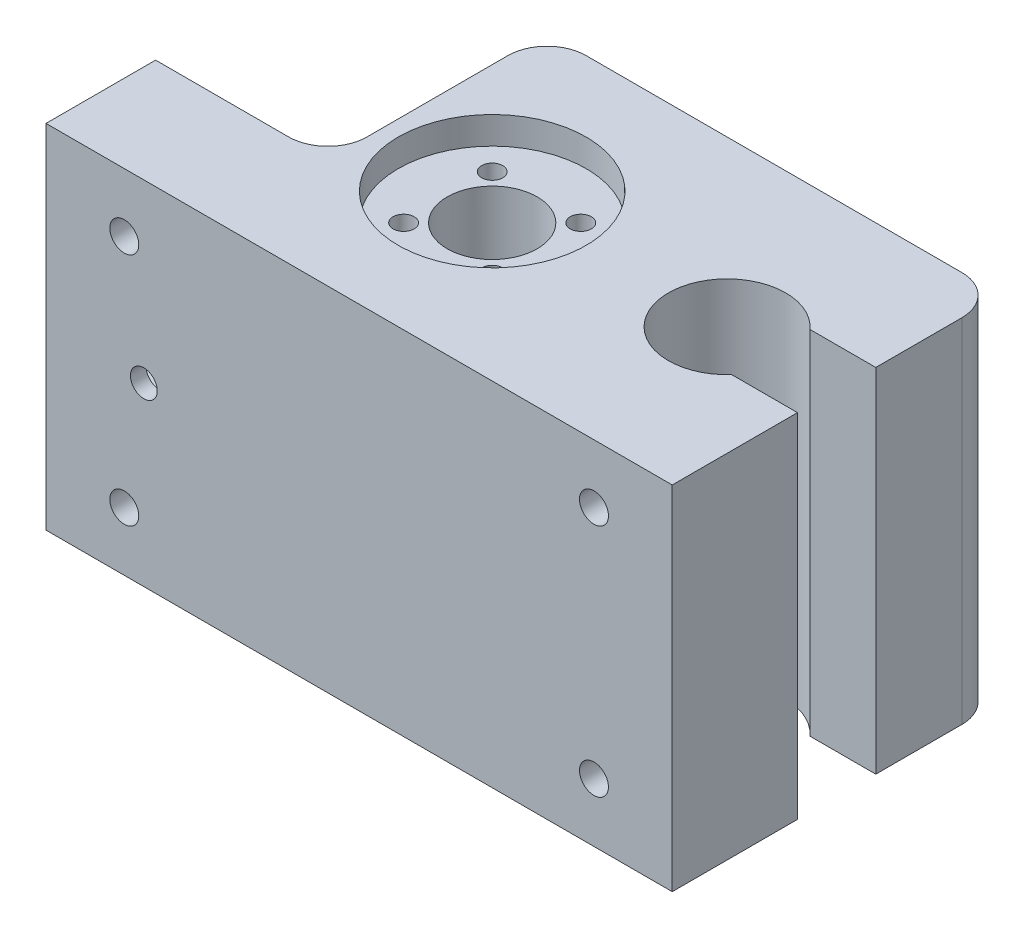
ISO-10303-21;
HEADER;
FILE_DESCRIPTION(('STEP AP214'),'2;1');
FILE_NAME('part.step','',(''),(''),'','','');
FILE_SCHEMA(('AUTOMOTIVE_DESIGN { 1 0 10303 214 1 1 1 1 }'));
ENDSEC;
DATA;
#1=APPLICATION_CONTEXT('core data for automotive mechanical design processes');
#2=APPLICATION_PROTOCOL_DEFINITION('international standard','automotive_design',2000,#1);
#3=PRODUCT_CONTEXT('',#1,'mechanical');
#4=PRODUCT('Part','Part','',(#3));
#5=PRODUCT_RELATED_PRODUCT_CATEGORY('part','',(#4));
#6=PRODUCT_DEFINITION_FORMATION('','',#4);
#7=PRODUCT_DEFINITION_CONTEXT('part definition',#1,'design');
#8=PRODUCT_DEFINITION('design','',#6,#7);
#9=PRODUCT_DEFINITION_SHAPE('','',#8);
#10=(LENGTH_UNIT() NAMED_UNIT(*) SI_UNIT(.MILLI.,.METRE.));
#11=(NAMED_UNIT(*) PLANE_ANGLE_UNIT() SI_UNIT($,.RADIAN.));
#12=(NAMED_UNIT(*) SI_UNIT($,.STERADIAN.) SOLID_ANGLE_UNIT());
#13=UNCERTAINTY_MEASURE_WITH_UNIT(LENGTH_MEASURE(1.E-05),#10,'distance_accuracy_value','');
#14=(GEOMETRIC_REPRESENTATION_CONTEXT(3) GLOBAL_UNCERTAINTY_ASSIGNED_CONTEXT((#13)) GLOBAL_UNIT_ASSIGNED_CONTEXT((#10,
#11,#12)) REPRESENTATION_CONTEXT('',''));
#15=CARTESIAN_POINT('',(0.,0.,0.));
#16=DIRECTION('',(0.,0.,1.));
#17=DIRECTION('',(1.,0.,0.));
#18=AXIS2_PLACEMENT_3D('',#15,#16,#17);
#19=CARTESIAN_POINT('',(41.6568542494964,26.5,15.3431457505133));
#20=DIRECTION('',(0.,1.,0.));
#21=DIRECTION('',(-1.,0.,0.));
#22=AXIS2_PLACEMENT_3D('',#19,#20,#21);
#23=CYLINDRICAL_SURFACE('',#22,1.35);
#24=CARTESIAN_POINT('',(41.6568542494964,41.5,15.3431457505133));
#25=DIRECTION('',(0.,1.,0.));
#26=DIRECTION('',(-1.,0.,0.));
#27=AXIS2_PLACEMENT_3D('',#24,#25,#26);
#28=CIRCLE('',#27,1.35);
#29=CARTESIAN_POINT('',(40.3068542494964,41.5,15.3431457505133));
#30=VERTEX_POINT('',#29);
#31=EDGE_CURVE('E348',#30,#30,#28,.T.);
#32=ORIENTED_EDGE('',*,*,#31,.T.);
#33=EDGE_LOOP('',(#32));
#34=FACE_BOUND('',#33,.T.);
#35=CARTESIAN_POINT('',(41.6568542494964,31.,15.3431457505133));
#36=DIRECTION('',(0.,-1.,0.));
#37=DIRECTION('',(1.,0.,0.));
#38=AXIS2_PLACEMENT_3D('',#35,#36,#37);
#39=CIRCLE('',#38,1.35);
#40=CARTESIAN_POINT('',(43.0068542494964,31.,15.3431457505133));
#41=VERTEX_POINT('',#40);
#42=EDGE_CURVE('E286',#41,#41,#39,.F.);
#43=ORIENTED_EDGE('',*,*,#42,.F.);
#44=EDGE_LOOP('',(#43));
#45=FACE_BOUND('',#44,.T.);
#46=ADVANCED_FACE('F35',(#34,#45),#23,.F.);
#47=CARTESIAN_POINT('',(41.6568542494967,26.5,26.656854249498));
#48=DIRECTION('',(0.,1.,0.));
#49=DIRECTION('',(-1.,0.,0.));
#50=AXIS2_PLACEMENT_3D('',#47,#48,#49);
#51=CYLINDRICAL_SURFACE('',#50,1.35);
#52=CARTESIAN_POINT('',(41.6568542494967,41.5,26.656854249498));
#53=DIRECTION('',(0.,1.,0.));
#54=DIRECTION('',(-1.,0.,0.));
#55=AXIS2_PLACEMENT_3D('',#52,#53,#54);
#56=CIRCLE('',#55,1.35);
#57=CARTESIAN_POINT('',(40.3068542494967,41.5,26.656854249498));
#58=VERTEX_POINT('',#57);
#59=EDGE_CURVE('E345',#58,#58,#56,.T.);
#60=ORIENTED_EDGE('',*,*,#59,.T.);
#61=EDGE_LOOP('',(#60));
#62=FACE_BOUND('',#61,.T.);
#63=CARTESIAN_POINT('',(41.6568542494967,31.,26.656854249498));
#64=DIRECTION('',(0.,-1.,0.));
#65=DIRECTION('',(1.,0.,0.));
#66=AXIS2_PLACEMENT_3D('',#63,#64,#65);
#67=CIRCLE('',#66,1.35);
#68=CARTESIAN_POINT('',(43.0068542494967,31.,26.656854249498));
#69=VERTEX_POINT('',#68);
#70=EDGE_CURVE('E280',#69,#69,#67,.F.);
#71=ORIENTED_EDGE('',*,*,#70,.F.);
#72=EDGE_LOOP('',(#71));
#73=FACE_BOUND('',#72,.T.);
#74=ADVANCED_FACE('F401',(#62,#73),#51,.F.);
#75=CARTESIAN_POINT('',(30.3431457505119,26.5,26.6568542494983));
#76=DIRECTION('',(0.,1.,0.));
#77=DIRECTION('',(-1.,0.,0.));
#78=AXIS2_PLACEMENT_3D('',#75,#76,#77);
#79=CYLINDRICAL_SURFACE('',#78,1.35);
#80=CARTESIAN_POINT('',(30.3431457505119,41.5,26.6568542494983));
#81=DIRECTION('',(0.,1.,0.));
#82=DIRECTION('',(-1.,0.,0.));
#83=AXIS2_PLACEMENT_3D('',#80,#81,#82);
#84=CIRCLE('',#83,1.35);
#85=CARTESIAN_POINT('',(28.9931457505119,41.5,26.6568542494983));
#86=VERTEX_POINT('',#85);
#87=EDGE_CURVE('E349',#86,#86,#84,.T.);
#88=ORIENTED_EDGE('',*,*,#87,.T.);
#89=EDGE_LOOP('',(#88));
#90=FACE_BOUND('',#89,.T.);
#91=CARTESIAN_POINT('',(30.3431457505119,31.,26.6568542494983));
#92=DIRECTION('',(0.,-1.,0.));
#93=DIRECTION('',(1.,0.,0.));
#94=AXIS2_PLACEMENT_3D('',#91,#92,#93);
#95=CIRCLE('',#94,1.35);
#96=CARTESIAN_POINT('',(31.6931457505119,31.,26.6568542494983));
#97=VERTEX_POINT('',#96);
#98=EDGE_CURVE('E275',#97,#97,#95,.F.);
#99=ORIENTED_EDGE('',*,*,#98,.F.);
#100=EDGE_LOOP('',(#99));
#101=FACE_BOUND('',#100,.T.);
#102=ADVANCED_FACE('F407',(#90,#101),#79,.F.);
#103=CARTESIAN_POINT('',(30.3431457505116,26.5,15.3431457505136));
#104=DIRECTION('',(0.,1.,0.));
#105=DIRECTION('',(-1.,0.,0.));
#106=AXIS2_PLACEMENT_3D('',#103,#104,#105);
#107=CYLINDRICAL_SURFACE('',#106,1.35);
#108=CARTESIAN_POINT('',(30.3431457505116,41.5,15.3431457505136));
#109=DIRECTION('',(0.,1.,0.));
#110=DIRECTION('',(-1.,0.,0.));
#111=AXIS2_PLACEMENT_3D('',#108,#109,#110);
#112=CIRCLE('',#111,1.35);
#113=CARTESIAN_POINT('',(28.9931457505116,41.5,15.3431457505136));
#114=VERTEX_POINT('',#113);
#115=EDGE_CURVE('E344',#114,#114,#112,.T.);
#116=ORIENTED_EDGE('',*,*,#115,.T.);
#117=EDGE_LOOP('',(#116));
#118=FACE_BOUND('',#117,.T.);
#119=CARTESIAN_POINT('',(30.3431457505116,31.,15.3431457505136));
#120=DIRECTION('',(0.,-1.,0.));
#121=DIRECTION('',(1.,0.,0.));
#122=AXIS2_PLACEMENT_3D('',#119,#120,#121);
#123=CIRCLE('',#122,1.35);
#124=CARTESIAN_POINT('',(31.6931457505116,31.,15.3431457505136));
#125=VERTEX_POINT('',#124);
#126=EDGE_CURVE('E271',#125,#125,#123,.F.);
#127=ORIENTED_EDGE('',*,*,#126,.F.);
#128=EDGE_LOOP('',(#127));
#129=FACE_BOUND('',#128,.T.);
#130=ADVANCED_FACE('F413',(#118,#129),#107,.F.);
#131=CARTESIAN_POINT('',(36.0000000000003,0.,21.0000000000058));
#132=DIRECTION('',(0.,1.,0.));
#133=DIRECTION('',(-1.,0.,0.));
#134=AXIS2_PLACEMENT_3D('',#131,#132,#133);
#135=CYLINDRICAL_SURFACE('',#134,5.75);
#136=CARTESIAN_POINT('',(36.0000000000003,41.5,21.0000000000058));
#137=DIRECTION('',(0.,1.,0.));
#138=DIRECTION('',(-1.,0.,0.));
#139=AXIS2_PLACEMENT_3D('',#136,#137,#138);
#140=CIRCLE('',#139,5.75);
#141=CARTESIAN_POINT('',(30.2500000000003,41.5,21.0000000000058));
#142=VERTEX_POINT('',#141);
#143=EDGE_CURVE('E339',#142,#142,#140,.T.);
#144=ORIENTED_EDGE('',*,*,#143,.T.);
#145=EDGE_LOOP('',(#144));
#146=FACE_BOUND('',#145,.T.);
#147=CARTESIAN_POINT('',(36.0000000000003,31.,21.0000000000058));
#148=DIRECTION('',(0.,-1.,0.));
#149=DIRECTION('',(1.,0.,0.));
#150=AXIS2_PLACEMENT_3D('',#147,#148,#149);
#151=CIRCLE('',#150,5.75);
#152=CARTESIAN_POINT('',(41.7500000000003,31.,21.0000000000058));
#153=VERTEX_POINT('',#152);
#154=EDGE_CURVE('E166',#153,#153,#151,.F.);
#155=ORIENTED_EDGE('',*,*,#154,.F.);
#156=EDGE_LOOP('',(#155));
#157=FACE_BOUND('',#156,.T.);
#158=ADVANCED_FACE('F591',(#146,#157),#135,.F.);
#159=CARTESIAN_POINT('',(80.,0.,42.));
#160=DIRECTION('',(-1.,0.,0.));
#161=DIRECTION('',(0.,0.,1.));
#162=AXIS2_PLACEMENT_3D('',#159,#160,#161);
#163=PLANE('',#162);
#164=DIRECTION('',(0.,0.,-1.));
#165=VECTOR('',#164,1.);
#166=CARTESIAN_POINT('',(80.,0.,42.));
#167=LINE('',#166,#165);
#168=CARTESIAN_POINT('',(80.,0.,42.));
#169=VERTEX_POINT('',#168);
#170=CARTESIAN_POINT('',(80.,0.,26.000000000006));
#171=VERTEX_POINT('',#170);
#172=EDGE_CURVE('E229',#169,#171,#167,.T.);
#173=ORIENTED_EDGE('',*,*,#172,.T.);
#174=DIRECTION('',(0.,1.,0.));
#175=VECTOR('',#174,1.);
#176=CARTESIAN_POINT('',(80.,0.,26.000000000006));
#177=LINE('',#176,#175);
#178=CARTESIAN_POINT('',(80.,45.,26.000000000006));
#179=VERTEX_POINT('',#178);
#180=EDGE_CURVE('E331',#171,#179,#177,.T.);
#181=ORIENTED_EDGE('',*,*,#180,.T.);
#182=DIRECTION('',(0.,0.,-1.));
#183=VECTOR('',#182,1.);
#184=CARTESIAN_POINT('',(80.,45.,42.));
#185=LINE('',#184,#183);
#186=CARTESIAN_POINT('',(80.,45.,42.));
#187=VERTEX_POINT('',#186);
#188=EDGE_CURVE('E225',#187,#179,#185,.T.);
#189=ORIENTED_EDGE('',*,*,#188,.F.);
#190=DIRECTION('',(0.,1.,0.));
#191=VECTOR('',#190,1.);
#192=CARTESIAN_POINT('',(80.,0.,42.));
#193=LINE('',#192,#191);
#194=EDGE_CURVE('E213',#169,#187,#193,.T.);
#195=ORIENTED_EDGE('',*,*,#194,.F.);
#196=EDGE_LOOP('',(#173,#181,#189,#195));
#197=FACE_BOUND('',#196,.T.);
#198=ADVANCED_FACE('F454',(#197),#163,.F.);
#199=CARTESIAN_POINT('',(0.,0.,42.));
#200=DIRECTION('',(1.,0.,0.));
#201=DIRECTION('',(0.,1.,0.));
#202=AXIS2_PLACEMENT_3D('',#199,#200,#201);
#203=PLANE('',#202);
#204=DIRECTION('',(0.,0.,1.));
#205=VECTOR('',#204,1.);
#206=CARTESIAN_POINT('',(0.,14.,30.));
#207=LINE('',#206,#205);
#208=CARTESIAN_POINT('',(0.,14.,30.));
#209=VERTEX_POINT('',#208);
#210=CARTESIAN_POINT('',(0.,14.,40.));
#211=VERTEX_POINT('',#210);
#212=EDGE_CURVE('E370',#209,#211,#207,.T.);
#213=ORIENTED_EDGE('',*,*,#212,.F.);
#214=DIRECTION('',(0.,-1.,0.));
#215=VECTOR('',#214,1.);
#216=CARTESIAN_POINT('',(0.,31.,30.));
#217=LINE('',#216,#215);
#218=CARTESIAN_POINT('',(0.,31.,30.));
#219=VERTEX_POINT('',#218);
#220=EDGE_CURVE('E360',#219,#209,#217,.T.);
#221=ORIENTED_EDGE('',*,*,#220,.F.);
#222=DIRECTION('',(0.,0.,-1.));
#223=VECTOR('',#222,1.);
#224=CARTESIAN_POINT('',(0.,31.,30.));
#225=LINE('',#224,#223);
#226=CARTESIAN_POINT('',(0.,31.,40.));
#227=VERTEX_POINT('',#226);
#228=EDGE_CURVE('E182',#227,#219,#225,.T.);
#229=ORIENTED_EDGE('',*,*,#228,.F.);
#230=DIRECTION('',(0.,1.,0.));
#231=VECTOR('',#230,1.);
#232=CARTESIAN_POINT('',(0.,31.,40.));
#233=LINE('',#232,#231);
#234=EDGE_CURVE('E372',#211,#227,#233,.T.);
#235=ORIENTED_EDGE('',*,*,#234,.F.);
#236=EDGE_LOOP('',(#213,#221,#229,#235));
#237=FACE_BOUND('',#236,.T.);
#238=DIRECTION('',(0.,0.,-1.));
#239=VECTOR('',#238,1.);
#240=CARTESIAN_POINT('',(0.,45.,42.));
#241=LINE('',#240,#239);
#242=CARTESIAN_POINT('',(0.,45.,42.));
#243=VERTEX_POINT('',#242);
#244=CARTESIAN_POINT('',(0.,45.,28.));
#245=VERTEX_POINT('',#244);
#246=EDGE_CURVE('E217',#243,#245,#241,.T.);
#247=ORIENTED_EDGE('',*,*,#246,.T.);
#248=DIRECTION('',(0.,1.,0.));
#249=VECTOR('',#248,1.);
#250=CARTESIAN_POINT('',(0.,0.,28.));
#251=LINE('',#250,#249);
#252=CARTESIAN_POINT('',(0.,0.,28.));
#253=VERTEX_POINT('',#252);
#254=EDGE_CURVE('E202',#253,#245,#251,.T.);
#255=ORIENTED_EDGE('',*,*,#254,.F.);
#256=DIRECTION('',(0.,0.,-1.));
#257=VECTOR('',#256,1.);
#258=CARTESIAN_POINT('',(0.,0.,42.));
#259=LINE('',#258,#257);
#260=CARTESIAN_POINT('',(0.,0.,42.));
#261=VERTEX_POINT('',#260);
#262=EDGE_CURVE('E232',#261,#253,#259,.T.);
#263=ORIENTED_EDGE('',*,*,#262,.F.);
#264=DIRECTION('',(0.,-1.,0.));
#265=VECTOR('',#264,1.);
#266=CARTESIAN_POINT('',(0.,0.,42.));
#267=LINE('',#266,#265);
#268=EDGE_CURVE('E207',#243,#261,#267,.T.);
#269=ORIENTED_EDGE('',*,*,#268,.F.);
#270=EDGE_LOOP('',(#247,#255,#263,#269));
#271=FACE_BOUND('',#270,.T.);
#272=ADVANCED_FACE('F381',(#237,#271),#203,.F.);
#273=CARTESIAN_POINT('',(0.,0.,42.));
#274=DIRECTION('',(0.,1.,0.));
#275=DIRECTION('',(-1.,0.,0.));
#276=AXIS2_PLACEMENT_3D('',#273,#274,#275);
#277=PLANE('',#276);
#278=CARTESIAN_POINT('',(36.0000000000003,0.,21.0000000000058));
#279=DIRECTION('',(0.,-1.,0.));
#280=DIRECTION('',(1.,0.,0.));
#281=AXIS2_PLACEMENT_3D('',#278,#279,#280);
#282=CIRCLE('',#281,12.5);
#283=CARTESIAN_POINT('',(48.5000000000003,0.,21.0000000000058));
#284=VERTEX_POINT('',#283);
#285=EDGE_CURVE('E167',#284,#284,#282,.T.);
#286=ORIENTED_EDGE('',*,*,#285,.F.);
#287=EDGE_LOOP('',(#286));
#288=FACE_BOUND('',#287,.T.);
#289=DIRECTION('',(1.,0.,0.));
#290=VECTOR('',#289,1.);
#291=CARTESIAN_POINT('',(0.,0.,0.));
#292=LINE('',#291,#290);
#293=CARTESIAN_POINT('',(27.,0.,0.));
#294=VERTEX_POINT('',#293);
#295=CARTESIAN_POINT('',(75.,0.,0.));
#296=VERTEX_POINT('',#295);
#297=EDGE_CURVE('E206',#294,#296,#292,.T.);
#298=ORIENTED_EDGE('',*,*,#297,.T.);
#299=CARTESIAN_POINT('',(75.,0.,5.));
#300=DIRECTION('',(0.,1.,0.));
#301=DIRECTION('',(-1.,0.,0.));
#302=AXIS2_PLACEMENT_3D('',#299,#300,#301);
#303=CIRCLE('',#302,5.);
#304=CARTESIAN_POINT('',(80.,0.,5.00000000000001));
#305=VERTEX_POINT('',#304);
#306=EDGE_CURVE('E260',#296,#305,#303,.F.);
#307=ORIENTED_EDGE('',*,*,#306,.T.);
#308=CARTESIAN_POINT('',(80.,0.,16.000000000006));
#309=VERTEX_POINT('',#308);
#310=EDGE_CURVE('E228',#309,#305,#167,.T.);
#311=ORIENTED_EDGE('',*,*,#310,.F.);
#312=DIRECTION('',(-1.,0.,0.));
#313=VECTOR('',#312,1.);
#314=CARTESIAN_POINT('',(67.9004612587687,0.,16.000000000006));
#315=LINE('',#314,#313);
#316=CARTESIAN_POINT('',(71.5901699437497,0.,16.000000000006));
#317=VERTEX_POINT('',#316);
#318=EDGE_CURVE('E321',#309,#317,#315,.T.);
#319=ORIENTED_EDGE('',*,*,#318,.T.);
#320=CARTESIAN_POINT('',(66.0000000000002,0.,21.000000000006));
#321=DIRECTION('',(0.,1.,0.));
#322=DIRECTION('',(-1.,0.,0.));
#323=AXIS2_PLACEMENT_3D('',#320,#321,#322);
#324=CIRCLE('',#323,7.5);
#325=CARTESIAN_POINT('',(71.5901699437497,0.,26.000000000006));
#326=VERTEX_POINT('',#325);
#327=EDGE_CURVE('E336',#317,#326,#324,.T.);
#328=ORIENTED_EDGE('',*,*,#327,.T.);
#329=DIRECTION('',(1.,0.,0.));
#330=VECTOR('',#329,1.);
#331=CARTESIAN_POINT('',(67.9004612587687,0.,26.000000000006));
#332=LINE('',#331,#330);
#333=EDGE_CURVE('E324',#326,#171,#332,.T.);
#334=ORIENTED_EDGE('',*,*,#333,.T.);
#335=ORIENTED_EDGE('',*,*,#172,.F.);
#336=DIRECTION('',(1.,0.,0.));
#337=VECTOR('',#336,1.);
#338=CARTESIAN_POINT('',(0.,0.,42.));
#339=LINE('',#338,#337);
#340=EDGE_CURVE('E210',#261,#169,#339,.T.);
#341=ORIENTED_EDGE('',*,*,#340,.F.);
#342=ORIENTED_EDGE('',*,*,#262,.T.);
#343=DIRECTION('',(1.,0.,0.));
#344=VECTOR('',#343,1.);
#345=CARTESIAN_POINT('',(0.,0.,28.));
#346=LINE('',#345,#344);
#347=CARTESIAN_POINT('',(17.,0.,28.));
#348=VERTEX_POINT('',#347);
#349=EDGE_CURVE('E198',#253,#348,#346,.T.);
#350=ORIENTED_EDGE('',*,*,#349,.T.);
#351=CARTESIAN_POINT('',(17.,0.,23.));
#352=DIRECTION('',(0.,1.,0.));
#353=DIRECTION('',(-1.,0.,0.));
#354=AXIS2_PLACEMENT_3D('',#351,#352,#353);
#355=CIRCLE('',#354,5.);
#356=CARTESIAN_POINT('',(22.,0.,23.));
#357=VERTEX_POINT('',#356);
#358=EDGE_CURVE('E43',#348,#357,#355,.T.);
#359=ORIENTED_EDGE('',*,*,#358,.T.);
#360=DIRECTION('',(0.,0.,-1.));
#361=VECTOR('',#360,1.);
#362=CARTESIAN_POINT('',(22.,0.,28.));
#363=LINE('',#362,#361);
#364=CARTESIAN_POINT('',(22.,0.,5.));
#365=VERTEX_POINT('',#364);
#366=EDGE_CURVE('E201',#357,#365,#363,.T.);
#367=ORIENTED_EDGE('',*,*,#366,.T.);
#368=CARTESIAN_POINT('',(27.,0.,5.));
#369=DIRECTION('',(0.,1.,0.));
#370=DIRECTION('',(-1.,0.,0.));
#371=AXIS2_PLACEMENT_3D('',#368,#369,#370);
#372=CIRCLE('',#371,5.);
#373=EDGE_CURVE('E258',#365,#294,#372,.F.);
#374=ORIENTED_EDGE('',*,*,#373,.T.);
#375=EDGE_LOOP('',(#298,#307,#311,#319,#328,#334,#335,#341,#342,#350,#359,#367,#374));
#376=FACE_BOUND('',#375,.T.);
#377=ADVANCED_FACE('F451',(#288,#376),#277,.F.);
#378=ORIENTED_EDGE('',*,*,#310,.T.);
#379=DIRECTION('',(0.,1.,0.));
#380=VECTOR('',#379,1.);
#381=CARTESIAN_POINT('',(80.,45.,5.));
#382=LINE('',#381,#380);
#383=CARTESIAN_POINT('',(80.,45.,5.00000000000001));
#384=VERTEX_POINT('',#383);
#385=EDGE_CURVE('E241',#305,#384,#382,.T.);
#386=ORIENTED_EDGE('',*,*,#385,.T.);
#387=CARTESIAN_POINT('',(80.,45.,16.000000000006));
#388=VERTEX_POINT('',#387);
#389=EDGE_CURVE('E224',#388,#384,#185,.T.);
#390=ORIENTED_EDGE('',*,*,#389,.F.);
#391=DIRECTION('',(0.,1.,0.));
#392=VECTOR('',#391,1.);
#393=CARTESIAN_POINT('',(80.,0.,16.000000000006));
#394=LINE('',#393,#392);
#395=EDGE_CURVE('E328',#309,#388,#394,.T.);
#396=ORIENTED_EDGE('',*,*,#395,.F.);
#397=EDGE_LOOP('',(#378,#386,#390,#396));
#398=FACE_BOUND('',#397,.T.);
#399=ADVANCED_FACE('F441',(#398),#163,.F.);
#400=CARTESIAN_POINT('',(0.,45.,42.));
#401=DIRECTION('',(0.,-1.,0.));
#402=DIRECTION('',(1.,0.,0.));
#403=AXIS2_PLACEMENT_3D('',#400,#401,#402);
#404=PLANE('',#403);
#405=ORIENTED_EDGE('',*,*,#389,.T.);
#406=CARTESIAN_POINT('',(75.,45.,5.));
#407=DIRECTION('',(0.,-1.,0.));
#408=DIRECTION('',(1.,0.,0.));
#409=AXIS2_PLACEMENT_3D('',#406,#407,#408);
#410=CIRCLE('',#409,5.);
#411=CARTESIAN_POINT('',(75.,45.,0.));
#412=VERTEX_POINT('',#411);
#413=EDGE_CURVE('E251',#384,#412,#410,.F.);
#414=ORIENTED_EDGE('',*,*,#413,.T.);
#415=DIRECTION('',(-1.,0.,0.));
#416=VECTOR('',#415,1.);
#417=CARTESIAN_POINT('',(0.,45.,0.));
#418=LINE('',#417,#416);
#419=CARTESIAN_POINT('',(27.,45.,0.));
#420=VERTEX_POINT('',#419);
#421=EDGE_CURVE('E211',#412,#420,#418,.T.);
#422=ORIENTED_EDGE('',*,*,#421,.T.);
#423=CARTESIAN_POINT('',(27.,45.,5.));
#424=DIRECTION('',(0.,-1.,0.));
#425=DIRECTION('',(1.,0.,0.));
#426=AXIS2_PLACEMENT_3D('',#423,#424,#425);
#427=CIRCLE('',#426,5.);
#428=CARTESIAN_POINT('',(22.,45.,5.));
#429=VERTEX_POINT('',#428);
#430=EDGE_CURVE('E249',#420,#429,#427,.F.);
#431=ORIENTED_EDGE('',*,*,#430,.T.);
#432=DIRECTION('',(0.,0.,-1.));
#433=VECTOR('',#432,1.);
#434=CARTESIAN_POINT('',(22.,45.,28.));
#435=LINE('',#434,#433);
#436=CARTESIAN_POINT('',(22.,45.,23.));
#437=VERTEX_POINT('',#436);
#438=EDGE_CURVE('E188',#437,#429,#435,.T.);
#439=ORIENTED_EDGE('',*,*,#438,.F.);
#440=CARTESIAN_POINT('',(17.,45.,23.));
#441=DIRECTION('',(0.,-1.,0.));
#442=DIRECTION('',(1.,0.,0.));
#443=AXIS2_PLACEMENT_3D('',#440,#441,#442);
#444=CIRCLE('',#443,5.);
#445=CARTESIAN_POINT('',(17.,45.,28.));
#446=VERTEX_POINT('',#445);
#447=EDGE_CURVE('E268',#437,#446,#444,.T.);
#448=ORIENTED_EDGE('',*,*,#447,.T.);
#449=DIRECTION('',(1.,0.,0.));
#450=VECTOR('',#449,1.);
#451=CARTESIAN_POINT('',(0.,45.,28.));
#452=LINE('',#451,#450);
#453=EDGE_CURVE('E184',#245,#446,#452,.T.);
#454=ORIENTED_EDGE('',*,*,#453,.F.);
#455=ORIENTED_EDGE('',*,*,#246,.F.);
#456=DIRECTION('',(-1.,0.,0.));
#457=VECTOR('',#456,1.);
#458=CARTESIAN_POINT('',(0.,45.,42.));
#459=LINE('',#458,#457);
#460=EDGE_CURVE('E215',#187,#243,#459,.T.);
#461=ORIENTED_EDGE('',*,*,#460,.F.);
#462=ORIENTED_EDGE('',*,*,#188,.T.);
#463=DIRECTION('',(1.,0.,0.));
#464=VECTOR('',#463,1.);
#465=CARTESIAN_POINT('',(67.9004612587687,45.,26.000000000006));
#466=LINE('',#465,#464);
#467=CARTESIAN_POINT('',(71.5901699437497,45.,26.000000000006));
#468=VERTEX_POINT('',#467);
#469=EDGE_CURVE('E325',#468,#179,#466,.T.);
#470=ORIENTED_EDGE('',*,*,#469,.F.);
#471=CARTESIAN_POINT('',(66.0000000000002,45.,21.000000000006));
#472=DIRECTION('',(0.,1.,0.));
#473=DIRECTION('',(-1.,0.,0.));
#474=AXIS2_PLACEMENT_3D('',#471,#472,#473);
#475=CIRCLE('',#474,7.5);
#476=CARTESIAN_POINT('',(71.5901699437497,45.,16.000000000006));
#477=VERTEX_POINT('',#476);
#478=EDGE_CURVE('E334',#477,#468,#475,.T.);
#479=ORIENTED_EDGE('',*,*,#478,.F.);
#480=DIRECTION('',(-1.,0.,0.));
#481=VECTOR('',#480,1.);
#482=CARTESIAN_POINT('',(67.9004612587687,45.,16.000000000006));
#483=LINE('',#482,#481);
#484=EDGE_CURVE('E320',#388,#477,#483,.T.);
#485=ORIENTED_EDGE('',*,*,#484,.F.);
#486=EDGE_LOOP('',(#405,#414,#422,#431,#439,#448,#454,#455,#461,#462,#470,#479,#485));
#487=FACE_BOUND('',#486,.T.);
#488=CARTESIAN_POINT('',(36.0000000000003,45.,21.0000000000058));
#489=DIRECTION('',(0.,1.,0.));
#490=DIRECTION('',(-1.,0.,0.));
#491=AXIS2_PLACEMENT_3D('',#488,#489,#490);
#492=CIRCLE('',#491,12.);
#493=CARTESIAN_POINT('',(24.0000000000003,45.,21.0000000000058));
#494=VERTEX_POINT('',#493);
#495=EDGE_CURVE('E356',#494,#494,#492,.T.);
#496=ORIENTED_EDGE('',*,*,#495,.F.);
#497=EDGE_LOOP('',(#496));
#498=FACE_BOUND('',#497,.T.);
#499=ADVANCED_FACE('F438',(#487,#498),#404,.F.);
#500=CARTESIAN_POINT('',(0.,0.,42.));
#501=DIRECTION('',(0.,0.,-1.));
#502=DIRECTION('',(-1.,0.,0.));
#503=AXIS2_PLACEMENT_3D('',#500,#501,#502);
#504=PLANE('',#503);
#505=CARTESIAN_POINT('',(9.99999999999999,7.5,42.));
#506=DIRECTION('',(0.,0.,1.));
#507=DIRECTION('',(1.,0.,0.));
#508=AXIS2_PLACEMENT_3D('',#505,#506,#507);
#509=CIRCLE('',#508,1.85);
#510=CARTESIAN_POINT('',(11.85,7.5,42.));
#511=VERTEX_POINT('',#510);
#512=EDGE_CURVE('E176',#511,#511,#509,.T.);
#513=ORIENTED_EDGE('',*,*,#512,.F.);
#514=EDGE_LOOP('',(#513));
#515=FACE_BOUND('',#514,.T.);
#516=CARTESIAN_POINT('',(70.,7.5,42.));
#517=DIRECTION('',(0.,0.,1.));
#518=DIRECTION('',(1.,0.,0.));
#519=AXIS2_PLACEMENT_3D('',#516,#517,#518);
#520=CIRCLE('',#519,1.85);
#521=CARTESIAN_POINT('',(71.85,7.5,42.));
#522=VERTEX_POINT('',#521);
#523=EDGE_CURVE('E300',#522,#522,#520,.T.);
#524=ORIENTED_EDGE('',*,*,#523,.F.);
#525=EDGE_LOOP('',(#524));
#526=FACE_BOUND('',#525,.T.);
#527=CARTESIAN_POINT('',(70.,37.5,42.));
#528=DIRECTION('',(0.,0.,1.));
#529=DIRECTION('',(1.,0.,0.));
#530=AXIS2_PLACEMENT_3D('',#527,#528,#529);
#531=CIRCLE('',#530,1.85000000000001);
#532=CARTESIAN_POINT('',(71.85,37.5,42.));
#533=VERTEX_POINT('',#532);
#534=EDGE_CURVE('E294',#533,#533,#531,.T.);
#535=ORIENTED_EDGE('',*,*,#534,.F.);
#536=EDGE_LOOP('',(#535));
#537=FACE_BOUND('',#536,.T.);
#538=CARTESIAN_POINT('',(9.99999999999999,37.5,42.));
#539=DIRECTION('',(0.,0.,1.));
#540=DIRECTION('',(1.,0.,0.));
#541=AXIS2_PLACEMENT_3D('',#538,#539,#540);
#542=CIRCLE('',#541,1.85);
#543=CARTESIAN_POINT('',(11.85,37.5,42.));
#544=VERTEX_POINT('',#543);
#545=EDGE_CURVE('E293',#544,#544,#542,.T.);
#546=ORIENTED_EDGE('',*,*,#545,.F.);
#547=EDGE_LOOP('',(#546));
#548=FACE_BOUND('',#547,.T.);
#549=CARTESIAN_POINT('',(12.5000000004521,22.5000000006777,42.));
#550=DIRECTION('',(0.,0.,1.));
#551=DIRECTION('',(1.,0.,0.));
#552=AXIS2_PLACEMENT_3D('',#549,#550,#551);
#553=CIRCLE('',#552,1.71233253243405);
#554=CARTESIAN_POINT('',(14.2123325328861,22.5000000006777,42.));
#555=VERTEX_POINT('',#554);
#556=EDGE_CURVE('E246',#555,#555,#553,.T.);
#557=ORIENTED_EDGE('',*,*,#556,.F.);
#558=EDGE_LOOP('',(#557));
#559=FACE_BOUND('',#558,.T.);
#560=ORIENTED_EDGE('',*,*,#268,.T.);
#561=ORIENTED_EDGE('',*,*,#340,.T.);
#562=ORIENTED_EDGE('',*,*,#194,.T.);
#563=ORIENTED_EDGE('',*,*,#460,.T.);
#564=EDGE_LOOP('',(#560,#561,#562,#563));
#565=FACE_BOUND('',#564,.T.);
#566=ADVANCED_FACE('F440',(#515,#526,#537,#548,#559,#565),#504,.F.);
#567=CARTESIAN_POINT('',(0.,0.,0.));
#568=DIRECTION('',(0.,0.,-1.));
#569=DIRECTION('',(-1.,0.,0.));
#570=AXIS2_PLACEMENT_3D('',#567,#568,#569);
#571=PLANE('',#570);
#572=ORIENTED_EDGE('',*,*,#421,.F.);
#573=DIRECTION('',(0.,1.,0.));
#574=VECTOR('',#573,1.);
#575=CARTESIAN_POINT('',(75.,0.,0.));
#576=LINE('',#575,#574);
#577=EDGE_CURVE('E256',#412,#296,#576,.F.);
#578=ORIENTED_EDGE('',*,*,#577,.T.);
#579=ORIENTED_EDGE('',*,*,#297,.F.);
#580=DIRECTION('',(0.,1.,0.));
#581=VECTOR('',#580,1.);
#582=CARTESIAN_POINT('',(27.,45.,0.));
#583=LINE('',#582,#581);
#584=EDGE_CURVE('E253',#294,#420,#583,.T.);
#585=ORIENTED_EDGE('',*,*,#584,.T.);
#586=EDGE_LOOP('',(#572,#578,#579,#585));
#587=FACE_BOUND('',#586,.T.);
#588=ADVANCED_FACE('F448',(#587),#571,.T.);
#589=CARTESIAN_POINT('',(22.,0.,28.));
#590=DIRECTION('',(1.,0.,0.));
#591=DIRECTION('',(0.,0.,-1.));
#592=AXIS2_PLACEMENT_3D('',#589,#590,#591);
#593=PLANE('',#592);
#594=ORIENTED_EDGE('',*,*,#438,.T.);
#595=DIRECTION('',(0.,1.,0.));
#596=VECTOR('',#595,1.);
#597=CARTESIAN_POINT('',(22.,0.,5.));
#598=LINE('',#597,#596);
#599=EDGE_CURVE('E57',#429,#365,#598,.F.);
#600=ORIENTED_EDGE('',*,*,#599,.T.);
#601=ORIENTED_EDGE('',*,*,#366,.F.);
#602=DIRECTION('',(0.,1.,0.));
#603=VECTOR('',#602,1.);
#604=CARTESIAN_POINT('',(22.,45.,23.));
#605=LINE('',#604,#603);
#606=EDGE_CURVE('E262',#357,#437,#605,.T.);
#607=ORIENTED_EDGE('',*,*,#606,.T.);
#608=EDGE_LOOP('',(#594,#600,#601,#607));
#609=FACE_BOUND('',#608,.T.);
#610=ADVANCED_FACE('F510',(#609),#593,.F.);
#611=CARTESIAN_POINT('',(0.,0.,28.));
#612=DIRECTION('',(0.,0.,1.));
#613=DIRECTION('',(1.,0.,0.));
#614=AXIS2_PLACEMENT_3D('',#611,#612,#613);
#615=PLANE('',#614);
#616=CARTESIAN_POINT('',(12.5000000004521,22.5000000006777,28.));
#617=DIRECTION('',(0.,0.,1.));
#618=DIRECTION('',(1.,0.,0.));
#619=AXIS2_PLACEMENT_3D('',#616,#617,#618);
#620=CIRCLE('',#619,1.71233253243405);
#621=CARTESIAN_POINT('',(14.2123325328861,22.5000000006777,28.));
#622=VERTEX_POINT('',#621);
#623=EDGE_CURVE('E317',#622,#622,#620,.T.);
#624=ORIENTED_EDGE('',*,*,#623,.T.);
#625=EDGE_LOOP('',(#624));
#626=FACE_BOUND('',#625,.T.);
#627=ORIENTED_EDGE('',*,*,#453,.T.);
#628=DIRECTION('',(0.,1.,0.));
#629=VECTOR('',#628,1.);
#630=CARTESIAN_POINT('',(17.,0.,28.));
#631=LINE('',#630,#629);
#632=EDGE_CURVE('E266',#446,#348,#631,.F.);
#633=ORIENTED_EDGE('',*,*,#632,.T.);
#634=ORIENTED_EDGE('',*,*,#349,.F.);
#635=ORIENTED_EDGE('',*,*,#254,.T.);
#636=EDGE_LOOP('',(#627,#633,#634,#635));
#637=FACE_BOUND('',#636,.T.);
#638=ADVANCED_FACE('F506',(#626,#637),#615,.F.);
#639=CARTESIAN_POINT('',(28.,31.,30.));
#640=DIRECTION('',(0.,0.,-1.));
#641=DIRECTION('',(-1.,0.,0.));
#642=AXIS2_PLACEMENT_3D('',#639,#640,#641);
#643=PLANE('',#642);
#644=CARTESIAN_POINT('',(12.5000000004521,22.5000000006777,30.));
#645=DIRECTION('',(0.,0.,-1.));
#646=DIRECTION('',(-1.,0.,0.));
#647=AXIS2_PLACEMENT_3D('',#644,#645,#646);
#648=CIRCLE('',#647,1.71233253243405);
#649=CARTESIAN_POINT('',(10.787667468018,22.5000000006777,30.));
#650=VERTEX_POINT('',#649);
#651=EDGE_CURVE('E245',#650,#650,#648,.T.);
#652=ORIENTED_EDGE('',*,*,#651,.T.);
#653=EDGE_LOOP('',(#652));
#654=FACE_BOUND('',#653,.T.);
#655=DIRECTION('',(-1.,0.,0.));
#656=VECTOR('',#655,1.);
#657=CARTESIAN_POINT('',(28.,14.,30.));
#658=LINE('',#657,#656);
#659=CARTESIAN_POINT('',(27.3253242135455,14.,30.));
#660=VERTEX_POINT('',#659);
#661=EDGE_CURVE('E175',#660,#209,#658,.T.);
#662=ORIENTED_EDGE('',*,*,#661,.F.);
#663=DIRECTION('',(0.,-1.,0.));
#664=VECTOR('',#663,1.);
#665=CARTESIAN_POINT('',(27.3253242135455,31.,30.));
#666=LINE('',#665,#664);
#667=CARTESIAN_POINT('',(27.3253242135455,31.,30.));
#668=VERTEX_POINT('',#667);
#669=EDGE_CURVE('E162',#660,#668,#666,.F.);
#670=ORIENTED_EDGE('',*,*,#669,.T.);
#671=DIRECTION('',(-1.,0.,0.));
#672=VECTOR('',#671,1.);
#673=CARTESIAN_POINT('',(28.,31.,30.));
#674=LINE('',#673,#672);
#675=EDGE_CURVE('E173',#668,#219,#674,.T.);
#676=ORIENTED_EDGE('',*,*,#675,.T.);
#677=ORIENTED_EDGE('',*,*,#220,.T.);
#678=EDGE_LOOP('',(#662,#670,#676,#677));
#679=FACE_BOUND('',#678,.T.);
#680=ADVANCED_FACE('F171',(#654,#679),#643,.F.);
#681=CARTESIAN_POINT('',(28.,31.,30.));
#682=DIRECTION('',(0.,1.,0.));
#683=DIRECTION('',(-1.,0.,0.));
#684=AXIS2_PLACEMENT_3D('',#681,#682,#683);
#685=PLANE('',#684);
#686=ORIENTED_EDGE('',*,*,#675,.F.);
#687=CARTESIAN_POINT('',(36.0000000000003,31.,21.0000000000058));
#688=DIRECTION('',(0.,-1.,0.));
#689=DIRECTION('',(1.,0.,0.));
#690=AXIS2_PLACEMENT_3D('',#687,#688,#689);
#691=CIRCLE('',#690,12.5);
#692=CARTESIAN_POINT('',(28.,31.,30.6046863561549));
#693=VERTEX_POINT('',#692);
#694=EDGE_CURVE('E50',#668,#693,#691,.T.);
#695=ORIENTED_EDGE('',*,*,#694,.T.);
#696=DIRECTION('',(0.,0.,-1.));
#697=VECTOR('',#696,1.);
#698=CARTESIAN_POINT('',(28.,31.,30.));
#699=LINE('',#698,#697);
#700=CARTESIAN_POINT('',(28.,31.,40.));
#701=VERTEX_POINT('',#700);
#702=EDGE_CURVE('E197',#701,#693,#699,.T.);
#703=ORIENTED_EDGE('',*,*,#702,.F.);
#704=DIRECTION('',(-1.,0.,0.));
#705=VECTOR('',#704,1.);
#706=CARTESIAN_POINT('',(28.,31.,40.));
#707=LINE('',#706,#705);
#708=EDGE_CURVE('E185',#701,#227,#707,.T.);
#709=ORIENTED_EDGE('',*,*,#708,.T.);
#710=ORIENTED_EDGE('',*,*,#228,.T.);
#711=EDGE_LOOP('',(#686,#695,#703,#709,#710));
#712=FACE_BOUND('',#711,.T.);
#713=ORIENTED_EDGE('',*,*,#42,.T.);
#714=EDGE_LOOP('',(#713));
#715=FACE_BOUND('',#714,.T.);
#716=ORIENTED_EDGE('',*,*,#70,.T.);
#717=EDGE_LOOP('',(#716));
#718=FACE_BOUND('',#717,.T.);
#719=ORIENTED_EDGE('',*,*,#98,.T.);
#720=EDGE_LOOP('',(#719));
#721=FACE_BOUND('',#720,.T.);
#722=ORIENTED_EDGE('',*,*,#126,.T.);
#723=EDGE_LOOP('',(#722));
#724=FACE_BOUND('',#723,.T.);
#725=ORIENTED_EDGE('',*,*,#154,.T.);
#726=EDGE_LOOP('',(#725));
#727=FACE_BOUND('',#726,.T.);
#728=ADVANCED_FACE('F179',(#712,#715,#718,#721,#724,#727),#685,.F.);
#729=CARTESIAN_POINT('',(28.,31.,40.));
#730=DIRECTION('',(0.,0.,1.));
#731=DIRECTION('',(1.,0.,0.));
#732=AXIS2_PLACEMENT_3D('',#729,#730,#731);
#733=PLANE('',#732);
#734=CARTESIAN_POINT('',(12.5000000004521,22.5000000006777,40.));
#735=DIRECTION('',(0.,0.,1.));
#736=DIRECTION('',(1.,0.,0.));
#737=AXIS2_PLACEMENT_3D('',#734,#735,#736);
#738=CIRCLE('',#737,1.71233253243405);
#739=CARTESIAN_POINT('',(14.2123325328861,22.5000000006777,40.));
#740=VERTEX_POINT('',#739);
#741=EDGE_CURVE('E242',#740,#740,#738,.T.);
#742=ORIENTED_EDGE('',*,*,#741,.T.);
#743=EDGE_LOOP('',(#742));
#744=FACE_BOUND('',#743,.T.);
#745=ORIENTED_EDGE('',*,*,#234,.T.);
#746=ORIENTED_EDGE('',*,*,#708,.F.);
#747=DIRECTION('',(0.,1.,0.));
#748=VECTOR('',#747,1.);
#749=CARTESIAN_POINT('',(28.,31.,40.));
#750=LINE('',#749,#748);
#751=CARTESIAN_POINT('',(28.,14.,40.));
#752=VERTEX_POINT('',#751);
#753=EDGE_CURVE('E365',#752,#701,#750,.T.);
#754=ORIENTED_EDGE('',*,*,#753,.F.);
#755=DIRECTION('',(-1.,0.,0.));
#756=VECTOR('',#755,1.);
#757=CARTESIAN_POINT('',(28.,14.,40.));
#758=LINE('',#757,#756);
#759=EDGE_CURVE('E190',#752,#211,#758,.T.);
#760=ORIENTED_EDGE('',*,*,#759,.T.);
#761=EDGE_LOOP('',(#745,#746,#754,#760));
#762=FACE_BOUND('',#761,.T.);
#763=ADVANCED_FACE('F376',(#744,#762),#733,.F.);
#764=CARTESIAN_POINT('',(28.,14.,30.));
#765=DIRECTION('',(0.,-1.,0.));
#766=DIRECTION('',(1.,0.,0.));
#767=AXIS2_PLACEMENT_3D('',#764,#765,#766);
#768=PLANE('',#767);
#769=DIRECTION('',(0.,0.,1.));
#770=VECTOR('',#769,1.);
#771=CARTESIAN_POINT('',(28.,14.,30.));
#772=LINE('',#771,#770);
#773=CARTESIAN_POINT('',(28.,14.,30.6046863561549));
#774=VERTEX_POINT('',#773);
#775=EDGE_CURVE('E363',#774,#752,#772,.T.);
#776=ORIENTED_EDGE('',*,*,#775,.F.);
#777=CARTESIAN_POINT('',(36.0000000000003,14.,21.0000000000058));
#778=DIRECTION('',(0.,-1.,0.));
#779=DIRECTION('',(1.,0.,0.));
#780=AXIS2_PLACEMENT_3D('',#777,#778,#779);
#781=CIRCLE('',#780,12.5);
#782=EDGE_CURVE('E177',#774,#660,#781,.T.);
#783=ORIENTED_EDGE('',*,*,#782,.T.);
#784=ORIENTED_EDGE('',*,*,#661,.T.);
#785=ORIENTED_EDGE('',*,*,#212,.T.);
#786=ORIENTED_EDGE('',*,*,#759,.F.);
#787=EDGE_LOOP('',(#776,#783,#784,#785,#786));
#788=FACE_BOUND('',#787,.T.);
#789=ADVANCED_FACE('F385',(#788),#768,.F.);
#790=CARTESIAN_POINT('',(28.,0.,0.));
#791=DIRECTION('',(-1.,0.,0.));
#792=DIRECTION('',(0.,-1.,0.));
#793=AXIS2_PLACEMENT_3D('',#790,#791,#792);
#794=PLANE('',#793);
#795=DIRECTION('',(0.,-1.,0.));
#796=VECTOR('',#795,1.);
#797=CARTESIAN_POINT('',(28.,31.,30.6046863561549));
#798=LINE('',#797,#796);
#799=EDGE_CURVE('E11',#774,#693,#798,.F.);
#800=ORIENTED_EDGE('',*,*,#799,.F.);
#801=ORIENTED_EDGE('',*,*,#775,.T.);
#802=ORIENTED_EDGE('',*,*,#753,.T.);
#803=ORIENTED_EDGE('',*,*,#702,.T.);
#804=EDGE_LOOP('',(#800,#801,#802,#803));
#805=FACE_BOUND('',#804,.T.);
#806=ADVANCED_FACE('F387',(#805),#794,.T.);
#807=CARTESIAN_POINT('',(36.0000000000003,41.5,21.0000000000058));
#808=DIRECTION('',(0.,1.,0.));
#809=DIRECTION('',(-1.,0.,0.));
#810=AXIS2_PLACEMENT_3D('',#807,#808,#809);
#811=CYLINDRICAL_SURFACE('',#810,12.);
#812=CARTESIAN_POINT('',(36.0000000000003,41.5,21.0000000000058));
#813=DIRECTION('',(0.,1.,0.));
#814=DIRECTION('',(-1.,0.,0.));
#815=AXIS2_PLACEMENT_3D('',#812,#813,#814);
#816=CIRCLE('',#815,12.);
#817=CARTESIAN_POINT('',(24.0000000000003,41.5,21.0000000000058));
#818=VERTEX_POINT('',#817);
#819=EDGE_CURVE('E357',#818,#818,#816,.T.);
#820=ORIENTED_EDGE('',*,*,#819,.F.);
#821=EDGE_LOOP('',(#820));
#822=FACE_BOUND('',#821,.T.);
#823=ORIENTED_EDGE('',*,*,#495,.T.);
#824=EDGE_LOOP('',(#823));
#825=FACE_BOUND('',#824,.T.);
#826=ADVANCED_FACE('F389',(#822,#825),#811,.F.);
#827=CARTESIAN_POINT('',(36.0000000000003,41.5,21.0000000000058));
#828=DIRECTION('',(0.,1.,0.));
#829=DIRECTION('',(-1.,0.,0.));
#830=AXIS2_PLACEMENT_3D('',#827,#828,#829);
#831=PLANE('',#830);
#832=ORIENTED_EDGE('',*,*,#143,.F.);
#833=EDGE_LOOP('',(#832));
#834=FACE_BOUND('',#833,.T.);
#835=ORIENTED_EDGE('',*,*,#115,.F.);
#836=EDGE_LOOP('',(#835));
#837=FACE_BOUND('',#836,.T.);
#838=ORIENTED_EDGE('',*,*,#87,.F.);
#839=EDGE_LOOP('',(#838));
#840=FACE_BOUND('',#839,.T.);
#841=ORIENTED_EDGE('',*,*,#59,.F.);
#842=EDGE_LOOP('',(#841));
#843=FACE_BOUND('',#842,.T.);
#844=ORIENTED_EDGE('',*,*,#31,.F.);
#845=EDGE_LOOP('',(#844));
#846=FACE_BOUND('',#845,.T.);
#847=ORIENTED_EDGE('',*,*,#819,.T.);
#848=EDGE_LOOP('',(#847));
#849=FACE_BOUND('',#848,.T.);
#850=ADVANCED_FACE('F395',(#834,#837,#840,#843,#846,#849),#831,.T.);
#851=CARTESIAN_POINT('',(66.0000000000002,0.,21.000000000006));
#852=DIRECTION('',(0.,1.,0.));
#853=DIRECTION('',(-1.,0.,0.));
#854=AXIS2_PLACEMENT_3D('',#851,#852,#853);
#855=CYLINDRICAL_SURFACE('',#854,7.5);
#856=ORIENTED_EDGE('',*,*,#478,.T.);
#857=DIRECTION('',(0.,1.,0.));
#858=VECTOR('',#857,1.);
#859=CARTESIAN_POINT('',(71.5901699437497,0.,26.0000000000059));
#860=LINE('',#859,#858);
#861=EDGE_CURVE('E238',#468,#326,#860,.F.);
#862=ORIENTED_EDGE('',*,*,#861,.T.);
#863=ORIENTED_EDGE('',*,*,#327,.F.);
#864=DIRECTION('',(0.,1.,0.));
#865=VECTOR('',#864,1.);
#866=CARTESIAN_POINT('',(71.5901699437497,0.,16.000000000006));
#867=LINE('',#866,#865);
#868=EDGE_CURVE('E235',#317,#477,#867,.T.);
#869=ORIENTED_EDGE('',*,*,#868,.T.);
#870=EDGE_LOOP('',(#856,#862,#863,#869));
#871=FACE_BOUND('',#870,.T.);
#872=ADVANCED_FACE('F416',(#871),#855,.F.);
#873=CARTESIAN_POINT('',(67.9004612587687,0.,16.000000000006));
#874=DIRECTION('',(0.,0.,-1.));
#875=DIRECTION('',(-1.,0.,0.));
#876=AXIS2_PLACEMENT_3D('',#873,#874,#875);
#877=PLANE('',#876);
#878=ORIENTED_EDGE('',*,*,#318,.F.);
#879=ORIENTED_EDGE('',*,*,#395,.T.);
#880=ORIENTED_EDGE('',*,*,#484,.T.);
#881=ORIENTED_EDGE('',*,*,#868,.F.);
#882=EDGE_LOOP('',(#878,#879,#880,#881));
#883=FACE_BOUND('',#882,.T.);
#884=ADVANCED_FACE('F421',(#883),#877,.F.);
#885=CARTESIAN_POINT('',(67.9004612587687,0.,26.000000000006));
#886=DIRECTION('',(0.,0.,1.));
#887=DIRECTION('',(1.,0.,0.));
#888=AXIS2_PLACEMENT_3D('',#885,#886,#887);
#889=PLANE('',#888);
#890=ORIENTED_EDGE('',*,*,#469,.T.);
#891=ORIENTED_EDGE('',*,*,#180,.F.);
#892=ORIENTED_EDGE('',*,*,#333,.F.);
#893=ORIENTED_EDGE('',*,*,#861,.F.);
#894=EDGE_LOOP('',(#890,#891,#892,#893));
#895=FACE_BOUND('',#894,.T.);
#896=ADVANCED_FACE('F743',(#895),#889,.F.);
#897=CARTESIAN_POINT('',(12.5000000004521,22.5000000006777,0.));
#898=DIRECTION('',(0.,0.,1.));
#899=DIRECTION('',(1.,0.,0.));
#900=AXIS2_PLACEMENT_3D('',#897,#898,#899);
#901=CYLINDRICAL_SURFACE('',#900,1.71233253243405);
#902=ORIENTED_EDGE('',*,*,#556,.T.);
#903=EDGE_LOOP('',(#902));
#904=FACE_BOUND('',#903,.T.);
#905=ORIENTED_EDGE('',*,*,#741,.F.);
#906=EDGE_LOOP('',(#905));
#907=FACE_BOUND('',#906,.T.);
#908=ADVANCED_FACE('F737',(#904,#907),#901,.F.);
#909=ORIENTED_EDGE('',*,*,#651,.F.);
#910=EDGE_LOOP('',(#909));
#911=FACE_BOUND('',#910,.T.);
#912=ORIENTED_EDGE('',*,*,#623,.F.);
#913=EDGE_LOOP('',(#912));
#914=FACE_BOUND('',#913,.T.);
#915=ADVANCED_FACE('F727',(#911,#914),#901,.F.);
#916=CARTESIAN_POINT('',(9.99999999999999,37.5,34.));
#917=DIRECTION('',(0.,0.,1.));
#918=DIRECTION('',(1.,0.,0.));
#919=AXIS2_PLACEMENT_3D('',#916,#917,#918);
#920=CYLINDRICAL_SURFACE('',#919,1.85);
#921=CARTESIAN_POINT('',(9.99999999999999,37.5,34.));
#922=DIRECTION('',(0.,0.,1.));
#923=DIRECTION('',(1.,0.,0.));
#924=AXIS2_PLACEMENT_3D('',#921,#922,#923);
#925=CIRCLE('',#924,1.85);
#926=CARTESIAN_POINT('',(11.85,37.5,34.));
#927=VERTEX_POINT('',#926);
#928=EDGE_CURVE('E308',#927,#927,#925,.T.);
#929=ORIENTED_EDGE('',*,*,#928,.F.);
#930=EDGE_LOOP('',(#929));
#931=FACE_BOUND('',#930,.T.);
#932=ORIENTED_EDGE('',*,*,#545,.T.);
#933=EDGE_LOOP('',(#932));
#934=FACE_BOUND('',#933,.T.);
#935=ADVANCED_FACE('F718',(#931,#934),#920,.F.);
#936=CARTESIAN_POINT('',(9.99999999999999,37.5,34.));
#937=DIRECTION('',(0.,0.,1.));
#938=DIRECTION('',(1.,0.,0.));
#939=AXIS2_PLACEMENT_3D('',#936,#937,#938);
#940=PLANE('',#939);
#941=ORIENTED_EDGE('',*,*,#928,.T.);
#942=EDGE_LOOP('',(#941));
#943=FACE_BOUND('',#942,.T.);
#944=ADVANCED_FACE('F709',(#943),#940,.T.);
#945=CARTESIAN_POINT('',(70.,37.5,34.));
#946=DIRECTION('',(0.,0.,1.));
#947=DIRECTION('',(1.,0.,0.));
#948=AXIS2_PLACEMENT_3D('',#945,#946,#947);
#949=CYLINDRICAL_SURFACE('',#948,1.85000000000001);
#950=CARTESIAN_POINT('',(70.,37.5,34.));
#951=DIRECTION('',(0.,0.,1.));
#952=DIRECTION('',(1.,0.,0.));
#953=AXIS2_PLACEMENT_3D('',#950,#951,#952);
#954=CIRCLE('',#953,1.85000000000001);
#955=CARTESIAN_POINT('',(71.85,37.5,34.));
#956=VERTEX_POINT('',#955);
#957=EDGE_CURVE('E290',#956,#956,#954,.T.);
#958=ORIENTED_EDGE('',*,*,#957,.F.);
#959=EDGE_LOOP('',(#958));
#960=FACE_BOUND('',#959,.T.);
#961=ORIENTED_EDGE('',*,*,#534,.T.);
#962=EDGE_LOOP('',(#961));
#963=FACE_BOUND('',#962,.T.);
#964=ADVANCED_FACE('F699',(#960,#963),#949,.F.);
#965=CARTESIAN_POINT('',(70.,37.5,34.));
#966=DIRECTION('',(0.,0.,1.));
#967=DIRECTION('',(1.,0.,0.));
#968=AXIS2_PLACEMENT_3D('',#965,#966,#967);
#969=PLANE('',#968);
#970=ORIENTED_EDGE('',*,*,#957,.T.);
#971=EDGE_LOOP('',(#970));
#972=FACE_BOUND('',#971,.T.);
#973=ADVANCED_FACE('F689',(#972),#969,.T.);
#974=CARTESIAN_POINT('',(70.,7.5,34.));
#975=DIRECTION('',(0.,0.,1.));
#976=DIRECTION('',(1.,0.,0.));
#977=AXIS2_PLACEMENT_3D('',#974,#975,#976);
#978=CYLINDRICAL_SURFACE('',#977,1.85);
#979=CARTESIAN_POINT('',(70.,7.5,34.));
#980=DIRECTION('',(0.,0.,1.));
#981=DIRECTION('',(1.,0.,0.));
#982=AXIS2_PLACEMENT_3D('',#979,#980,#981);
#983=CIRCLE('',#982,1.85);
#984=CARTESIAN_POINT('',(71.85,7.5,34.));
#985=VERTEX_POINT('',#984);
#986=EDGE_CURVE('E297',#985,#985,#983,.T.);
#987=ORIENTED_EDGE('',*,*,#986,.F.);
#988=EDGE_LOOP('',(#987));
#989=FACE_BOUND('',#988,.T.);
#990=ORIENTED_EDGE('',*,*,#523,.T.);
#991=EDGE_LOOP('',(#990));
#992=FACE_BOUND('',#991,.T.);
#993=ADVANCED_FACE('F679',(#989,#992),#978,.F.);
#994=CARTESIAN_POINT('',(70.,7.5,34.));
#995=DIRECTION('',(0.,0.,1.));
#996=DIRECTION('',(1.,0.,0.));
#997=AXIS2_PLACEMENT_3D('',#994,#995,#996);
#998=PLANE('',#997);
#999=ORIENTED_EDGE('',*,*,#986,.T.);
#1000=EDGE_LOOP('',(#999));
#1001=FACE_BOUND('',#1000,.T.);
#1002=ADVANCED_FACE('F669',(#1001),#998,.T.);
#1003=CARTESIAN_POINT('',(9.99999999999999,7.5,34.));
#1004=DIRECTION('',(0.,0.,1.));
#1005=DIRECTION('',(1.,0.,0.));
#1006=AXIS2_PLACEMENT_3D('',#1003,#1004,#1005);
#1007=CYLINDRICAL_SURFACE('',#1006,1.85);
#1008=CARTESIAN_POINT('',(9.99999999999999,7.5,34.));
#1009=DIRECTION('',(0.,0.,1.));
#1010=DIRECTION('',(1.,0.,0.));
#1011=AXIS2_PLACEMENT_3D('',#1008,#1009,#1010);
#1012=CIRCLE('',#1011,1.85);
#1013=CARTESIAN_POINT('',(11.85,7.5,34.));
#1014=VERTEX_POINT('',#1013);
#1015=EDGE_CURVE('E303',#1014,#1014,#1012,.T.);
#1016=ORIENTED_EDGE('',*,*,#1015,.F.);
#1017=EDGE_LOOP('',(#1016));
#1018=FACE_BOUND('',#1017,.T.);
#1019=ORIENTED_EDGE('',*,*,#512,.T.);
#1020=EDGE_LOOP('',(#1019));
#1021=FACE_BOUND('',#1020,.T.);
#1022=ADVANCED_FACE('F658',(#1018,#1021),#1007,.F.);
#1023=CARTESIAN_POINT('',(9.99999999999999,7.5,34.));
#1024=DIRECTION('',(0.,0.,1.));
#1025=DIRECTION('',(1.,0.,0.));
#1026=AXIS2_PLACEMENT_3D('',#1023,#1024,#1025);
#1027=PLANE('',#1026);
#1028=ORIENTED_EDGE('',*,*,#1015,.T.);
#1029=EDGE_LOOP('',(#1028));
#1030=FACE_BOUND('',#1029,.T.);
#1031=ADVANCED_FACE('F466',(#1030),#1027,.T.);
#1032=CARTESIAN_POINT('',(75.,0.,5.));
#1033=DIRECTION('',(0.,-1.,0.));
#1034=DIRECTION('',(0.,0.,-1.));
#1035=AXIS2_PLACEMENT_3D('',#1032,#1033,#1034);
#1036=CYLINDRICAL_SURFACE('',#1035,5.);
#1037=ORIENTED_EDGE('',*,*,#306,.F.);
#1038=ORIENTED_EDGE('',*,*,#577,.F.);
#1039=ORIENTED_EDGE('',*,*,#413,.F.);
#1040=ORIENTED_EDGE('',*,*,#385,.F.);
#1041=EDGE_LOOP('',(#1037,#1038,#1039,#1040));
#1042=FACE_BOUND('',#1041,.T.);
#1043=ADVANCED_FACE('F463',(#1042),#1036,.T.);
#1044=CARTESIAN_POINT('',(27.,0.,5.));
#1045=DIRECTION('',(0.,-1.,0.));
#1046=DIRECTION('',(0.,0.,-1.));
#1047=AXIS2_PLACEMENT_3D('',#1044,#1045,#1046);
#1048=CYLINDRICAL_SURFACE('',#1047,5.);
#1049=ORIENTED_EDGE('',*,*,#373,.F.);
#1050=ORIENTED_EDGE('',*,*,#599,.F.);
#1051=ORIENTED_EDGE('',*,*,#430,.F.);
#1052=ORIENTED_EDGE('',*,*,#584,.F.);
#1053=EDGE_LOOP('',(#1049,#1050,#1051,#1052));
#1054=FACE_BOUND('',#1053,.T.);
#1055=ADVANCED_FACE('F465',(#1054),#1048,.T.);
#1056=CARTESIAN_POINT('',(17.,0.,23.));
#1057=DIRECTION('',(0.,-1.,0.));
#1058=DIRECTION('',(0.,0.,-1.));
#1059=AXIS2_PLACEMENT_3D('',#1056,#1057,#1058);
#1060=CYLINDRICAL_SURFACE('',#1059,5.);
#1061=ORIENTED_EDGE('',*,*,#358,.F.);
#1062=ORIENTED_EDGE('',*,*,#632,.F.);
#1063=ORIENTED_EDGE('',*,*,#447,.F.);
#1064=ORIENTED_EDGE('',*,*,#606,.F.);
#1065=EDGE_LOOP('',(#1061,#1062,#1063,#1064));
#1066=FACE_BOUND('',#1065,.T.);
#1067=ADVANCED_FACE('F37',(#1066),#1060,.F.);
#1068=CARTESIAN_POINT('',(36.0000000000003,31.,21.0000000000058));
#1069=DIRECTION('',(0.,-1.,0.));
#1070=DIRECTION('',(1.,0.,0.));
#1071=AXIS2_PLACEMENT_3D('',#1068,#1069,#1070);
#1072=CYLINDRICAL_SURFACE('',#1071,12.5);
#1073=ORIENTED_EDGE('',*,*,#285,.T.);
#1074=EDGE_LOOP('',(#1073));
#1075=FACE_BOUND('',#1074,.T.);
#1076=ORIENTED_EDGE('',*,*,#782,.F.);
#1077=ORIENTED_EDGE('',*,*,#799,.T.);
#1078=ORIENTED_EDGE('',*,*,#694,.F.);
#1079=ORIENTED_EDGE('',*,*,#669,.F.);
#1080=EDGE_LOOP('',(#1076,#1077,#1078,#1079));
#1081=FACE_BOUND('',#1080,.T.);
#1082=ADVANCED_FACE('F161',(#1075,#1081),#1072,.F.);
#1083=CLOSED_SHELL('',(#46,#74,#102,#130,#158,#198,#272,#377,#399,#499,#566,#588,#610,#638,#680,
#728,#763,#789,#806,#826,#850,#872,#884,#896,#908,#915,#935,#944,#964,#973,#993,#1002,#1022,
#1031,#1043,#1055,#1067,#1082));
#1084=MANIFOLD_SOLID_BREP('B2',#1083);
#1085=ADVANCED_BREP_SHAPE_REPRESENTATION('',(#18,#1084),#14);
#1086=SHAPE_DEFINITION_REPRESENTATION(#9,#1085);
ENDSEC;
END-ISO-10303-21;
